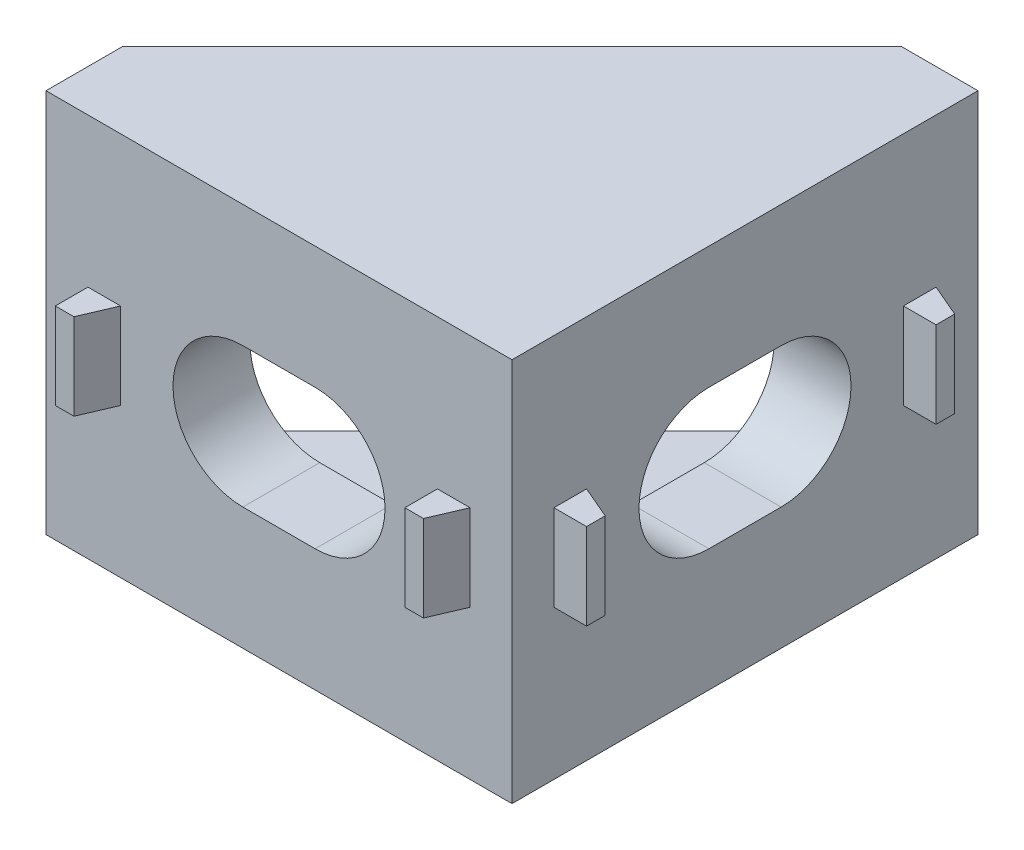
ISO-10303-21;
HEADER;
FILE_DESCRIPTION(('STEP AP214'),'2;1');
FILE_NAME('part.step','',(''),(''),'','','');
FILE_SCHEMA(('AUTOMOTIVE_DESIGN { 1 0 10303 214 1 1 1 1 }'));
ENDSEC;
DATA;
#1=APPLICATION_CONTEXT('core data for automotive mechanical design processes');
#2=APPLICATION_PROTOCOL_DEFINITION('international standard','automotive_design',2000,#1);
#3=PRODUCT_CONTEXT('',#1,'mechanical');
#4=PRODUCT('Part','Part','',(#3));
#5=PRODUCT_RELATED_PRODUCT_CATEGORY('part','',(#4));
#6=PRODUCT_DEFINITION_FORMATION('','',#4);
#7=PRODUCT_DEFINITION_CONTEXT('part definition',#1,'design');
#8=PRODUCT_DEFINITION('design','',#6,#7);
#9=PRODUCT_DEFINITION_SHAPE('','',#8);
#10=(LENGTH_UNIT() NAMED_UNIT(*) SI_UNIT(.MILLI.,.METRE.));
#11=(NAMED_UNIT(*) PLANE_ANGLE_UNIT() SI_UNIT($,.RADIAN.));
#12=(NAMED_UNIT(*) SI_UNIT($,.STERADIAN.) SOLID_ANGLE_UNIT());
#13=UNCERTAINTY_MEASURE_WITH_UNIT(LENGTH_MEASURE(1.E-05),#10,'distance_accuracy_value','');
#14=(GEOMETRIC_REPRESENTATION_CONTEXT(3) GLOBAL_UNCERTAINTY_ASSIGNED_CONTEXT((#13)) GLOBAL_UNIT_ASSIGNED_CONTEXT((#10,
#11,#12)) REPRESENTATION_CONTEXT('',''));
#15=CARTESIAN_POINT('',(0.,0.,0.));
#16=DIRECTION('',(0.,0.,1.));
#17=DIRECTION('',(1.,0.,0.));
#18=AXIS2_PLACEMENT_3D('',#15,#16,#17);
#19=CARTESIAN_POINT('',(0.,0.,0.));
#20=DIRECTION('',(0.,0.,-1.));
#21=DIRECTION('',(-1.,0.,0.));
#22=AXIS2_PLACEMENT_3D('',#19,#20,#21);
#23=PLANE('',#22);
#24=DIRECTION('',(1.,0.,0.));
#25=VECTOR('',#24,1.);
#26=CARTESIAN_POINT('',(-10.,6.05,0.));
#27=LINE('',#26,#25);
#28=CARTESIAN_POINT('',(-10.,6.05,0.));
#29=VERTEX_POINT('',#28);
#30=CARTESIAN_POINT('',(6.7,6.05,0.));
#31=VERTEX_POINT('',#30);
#32=EDGE_CURVE('E259',#29,#31,#27,.T.);
#33=ORIENTED_EDGE('',*,*,#32,.T.);
#34=DIRECTION('',(0.,-1.,0.));
#35=VECTOR('',#34,1.);
#36=CARTESIAN_POINT('',(6.7,0.,0.));
#37=LINE('',#36,#35);
#38=CARTESIAN_POINT('',(6.7,-6.05,0.));
#39=VERTEX_POINT('',#38);
#40=EDGE_CURVE('E275',#31,#39,#37,.T.);
#41=ORIENTED_EDGE('',*,*,#40,.T.);
#42=DIRECTION('',(-1.,0.,0.));
#43=VECTOR('',#42,1.);
#44=CARTESIAN_POINT('',(-10.,-6.05,0.));
#45=LINE('',#44,#43);
#46=CARTESIAN_POINT('',(-10.,-6.05,0.));
#47=VERTEX_POINT('',#46);
#48=EDGE_CURVE('E420',#39,#47,#45,.T.);
#49=ORIENTED_EDGE('',*,*,#48,.T.);
#50=DIRECTION('',(0.,-1.,0.));
#51=VECTOR('',#50,1.);
#52=CARTESIAN_POINT('',(-10.,-8.25,0.));
#53=LINE('',#52,#51);
#54=EDGE_CURVE('E390',#29,#47,#53,.T.);
#55=ORIENTED_EDGE('',*,*,#54,.F.);
#56=EDGE_LOOP('',(#33,#41,#49,#55));
#57=FACE_BOUND('',#56,.T.);
#58=DIRECTION('',(-1.,0.,0.));
#59=VECTOR('',#58,1.);
#60=CARTESIAN_POINT('',(-1.55,3.,0.));
#61=LINE('',#60,#59);
#62=CARTESIAN_POINT('',(1.55,3.,0.));
#63=VERTEX_POINT('',#62);
#64=CARTESIAN_POINT('',(-1.55,3.,0.));
#65=VERTEX_POINT('',#64);
#66=EDGE_CURVE('E363',#63,#65,#61,.T.);
#67=ORIENTED_EDGE('',*,*,#66,.T.);
#68=CARTESIAN_POINT('',(-1.55,0.,0.));
#69=DIRECTION('',(0.,0.,1.));
#70=DIRECTION('',(1.,0.,0.));
#71=AXIS2_PLACEMENT_3D('',#68,#69,#70);
#72=CIRCLE('',#71,3.);
#73=CARTESIAN_POINT('',(-1.55,-3.,0.));
#74=VERTEX_POINT('',#73);
#75=EDGE_CURVE('E359',#65,#74,#72,.T.);
#76=ORIENTED_EDGE('',*,*,#75,.T.);
#77=DIRECTION('',(1.,0.,0.));
#78=VECTOR('',#77,1.);
#79=CARTESIAN_POINT('',(-1.55,-3.,0.));
#80=LINE('',#79,#78);
#81=CARTESIAN_POINT('',(1.55,-3.,0.));
#82=VERTEX_POINT('',#81);
#83=EDGE_CURVE('E373',#74,#82,#80,.T.);
#84=ORIENTED_EDGE('',*,*,#83,.T.);
#85=CARTESIAN_POINT('',(1.55,0.,0.));
#86=DIRECTION('',(0.,0.,1.));
#87=DIRECTION('',(1.,0.,0.));
#88=AXIS2_PLACEMENT_3D('',#85,#86,#87);
#89=CIRCLE('',#88,3.);
#90=EDGE_CURVE('E376',#82,#63,#89,.T.);
#91=ORIENTED_EDGE('',*,*,#90,.T.);
#92=EDGE_LOOP('',(#67,#76,#84,#91));
#93=FACE_BOUND('',#92,.T.);
#94=ADVANCED_FACE('F40',(#57,#93),#23,.T.);
#95=CARTESIAN_POINT('',(6.7,0.,0.));
#96=DIRECTION('',(1.,0.,0.));
#97=DIRECTION('',(0.,0.,-1.));
#98=AXIS2_PLACEMENT_3D('',#95,#96,#97);
#99=PLANE('',#98);
#100=DIRECTION('',(0.,0.,1.));
#101=VECTOR('',#100,1.);
#102=CARTESIAN_POINT('',(6.7,3.,-5.15));
#103=LINE('',#102,#101);
#104=CARTESIAN_POINT('',(6.7,3.00000000000001,-8.25));
#105=VERTEX_POINT('',#104);
#106=CARTESIAN_POINT('',(6.7,3.,-5.15));
#107=VERTEX_POINT('',#106);
#108=EDGE_CURVE('E499',#105,#107,#103,.T.);
#109=ORIENTED_EDGE('',*,*,#108,.T.);
#110=CARTESIAN_POINT('',(6.7,0.,-5.15));
#111=DIRECTION('',(1.,0.,0.));
#112=DIRECTION('',(0.,0.,-1.));
#113=AXIS2_PLACEMENT_3D('',#110,#111,#112);
#114=CIRCLE('',#113,3.);
#115=CARTESIAN_POINT('',(6.7,-3.,-5.15));
#116=VERTEX_POINT('',#115);
#117=EDGE_CURVE('E489',#107,#116,#114,.T.);
#118=ORIENTED_EDGE('',*,*,#117,.T.);
#119=DIRECTION('',(0.,0.,-1.));
#120=VECTOR('',#119,1.);
#121=CARTESIAN_POINT('',(6.7,-3.,-5.15));
#122=LINE('',#121,#120);
#123=CARTESIAN_POINT('',(6.7,-3.,-8.25));
#124=VERTEX_POINT('',#123);
#125=EDGE_CURVE('E492',#116,#124,#122,.T.);
#126=ORIENTED_EDGE('',*,*,#125,.T.);
#127=CARTESIAN_POINT('',(6.7,0.,-8.25));
#128=DIRECTION('',(1.,0.,0.));
#129=DIRECTION('',(0.,0.,-1.));
#130=AXIS2_PLACEMENT_3D('',#127,#128,#129);
#131=CIRCLE('',#130,3.);
#132=EDGE_CURVE('E496',#124,#105,#131,.T.);
#133=ORIENTED_EDGE('',*,*,#132,.T.);
#134=EDGE_LOOP('',(#109,#118,#126,#133));
#135=FACE_BOUND('',#134,.T.);
#136=ORIENTED_EDGE('',*,*,#40,.F.);
#137=DIRECTION('',(0.,0.,-1.));
#138=VECTOR('',#137,1.);
#139=CARTESIAN_POINT('',(6.7,6.05,0.));
#140=LINE('',#139,#138);
#141=CARTESIAN_POINT('',(6.7,6.05,-16.7));
#142=VERTEX_POINT('',#141);
#143=EDGE_CURVE('E264',#31,#142,#140,.T.);
#144=ORIENTED_EDGE('',*,*,#143,.T.);
#145=DIRECTION('',(0.,1.,0.));
#146=VECTOR('',#145,1.);
#147=CARTESIAN_POINT('',(6.7,-8.25,-16.7));
#148=LINE('',#147,#146);
#149=CARTESIAN_POINT('',(6.7,-6.05,-16.7));
#150=VERTEX_POINT('',#149);
#151=EDGE_CURVE('E273',#150,#142,#148,.T.);
#152=ORIENTED_EDGE('',*,*,#151,.F.);
#153=DIRECTION('',(0.,0.,1.));
#154=VECTOR('',#153,1.);
#155=CARTESIAN_POINT('',(6.7,-6.05,0.));
#156=LINE('',#155,#154);
#157=EDGE_CURVE('E418',#150,#39,#156,.T.);
#158=ORIENTED_EDGE('',*,*,#157,.T.);
#159=EDGE_LOOP('',(#136,#144,#152,#158));
#160=FACE_BOUND('',#159,.T.);
#161=ADVANCED_FACE('F271',(#135,#160),#99,.F.);
#162=CARTESIAN_POINT('',(10.,-8.25,3.3));
#163=DIRECTION('',(-1.,0.,0.));
#164=DIRECTION('',(0.,0.,1.));
#165=AXIS2_PLACEMENT_3D('',#162,#163,#164);
#166=PLANE('',#165);
#167=DIRECTION('',(0.,1.,0.));
#168=VECTOR('',#167,1.);
#169=CARTESIAN_POINT('',(10.,-1.85,0.1));
#170=LINE('',#169,#168);
#171=CARTESIAN_POINT('',(10.,-1.85,0.1));
#172=VERTEX_POINT('',#171);
#173=CARTESIAN_POINT('',(10.,1.85,0.1));
#174=VERTEX_POINT('',#173);
#175=EDGE_CURVE('E459',#172,#174,#170,.T.);
#176=ORIENTED_EDGE('',*,*,#175,.F.);
#177=DIRECTION('',(0.,0.,-1.));
#178=VECTOR('',#177,1.);
#179=CARTESIAN_POINT('',(10.,-1.85,1.5));
#180=LINE('',#179,#178);
#181=CARTESIAN_POINT('',(10.,-1.85,1.5));
#182=VERTEX_POINT('',#181);
#183=EDGE_CURVE('E468',#182,#172,#180,.T.);
#184=ORIENTED_EDGE('',*,*,#183,.F.);
#185=DIRECTION('',(0.,-1.,0.));
#186=VECTOR('',#185,1.);
#187=CARTESIAN_POINT('',(10.,-1.85,1.5));
#188=LINE('',#187,#186);
#189=CARTESIAN_POINT('',(10.,1.85,1.5));
#190=VERTEX_POINT('',#189);
#191=EDGE_CURVE('E478',#190,#182,#188,.T.);
#192=ORIENTED_EDGE('',*,*,#191,.F.);
#193=DIRECTION('',(0.,0.,1.));
#194=VECTOR('',#193,1.);
#195=CARTESIAN_POINT('',(10.,1.85,1.5));
#196=LINE('',#195,#194);
#197=EDGE_CURVE('E475',#174,#190,#196,.T.);
#198=ORIENTED_EDGE('',*,*,#197,.F.);
#199=EDGE_LOOP('',(#176,#184,#192,#198));
#200=FACE_BOUND('',#199,.T.);
#201=DIRECTION('',(0.,0.,-1.));
#202=VECTOR('',#201,1.);
#203=CARTESIAN_POINT('',(10.,-8.25,3.3));
#204=LINE('',#203,#202);
#205=CARTESIAN_POINT('',(10.,-8.25,3.3));
#206=VERTEX_POINT('',#205);
#207=CARTESIAN_POINT('',(10.,-8.25,-16.7));
#208=VERTEX_POINT('',#207);
#209=EDGE_CURVE('E401',#206,#208,#204,.T.);
#210=ORIENTED_EDGE('',*,*,#209,.T.);
#211=DIRECTION('',(0.,1.,0.));
#212=VECTOR('',#211,1.);
#213=CARTESIAN_POINT('',(10.,-8.25,-16.7));
#214=LINE('',#213,#212);
#215=CARTESIAN_POINT('',(10.,8.25,-16.7));
#216=VERTEX_POINT('',#215);
#217=EDGE_CURVE('E282',#208,#216,#214,.T.);
#218=ORIENTED_EDGE('',*,*,#217,.T.);
#219=DIRECTION('',(0.,0.,-1.));
#220=VECTOR('',#219,1.);
#221=CARTESIAN_POINT('',(10.,8.25,3.3));
#222=LINE('',#221,#220);
#223=CARTESIAN_POINT('',(10.,8.25,3.3));
#224=VERTEX_POINT('',#223);
#225=EDGE_CURVE('E11',#224,#216,#222,.T.);
#226=ORIENTED_EDGE('',*,*,#225,.F.);
#227=DIRECTION('',(0.,1.,0.));
#228=VECTOR('',#227,1.);
#229=CARTESIAN_POINT('',(10.,-8.25,3.3));
#230=LINE('',#229,#228);
#231=EDGE_CURVE('E391',#206,#224,#230,.T.);
#232=ORIENTED_EDGE('',*,*,#231,.F.);
#233=EDGE_LOOP('',(#210,#218,#226,#232));
#234=FACE_BOUND('',#233,.T.);
#235=CARTESIAN_POINT('',(10.,0.,-5.15));
#236=DIRECTION('',(1.,0.,0.));
#237=DIRECTION('',(0.,0.,-1.));
#238=AXIS2_PLACEMENT_3D('',#235,#236,#237);
#239=CIRCLE('',#238,3.);
#240=CARTESIAN_POINT('',(10.,3.,-5.15));
#241=VERTEX_POINT('',#240);
#242=CARTESIAN_POINT('',(10.,-3.,-5.15));
#243=VERTEX_POINT('',#242);
#244=EDGE_CURVE('E488',#241,#243,#239,.T.);
#245=ORIENTED_EDGE('',*,*,#244,.F.);
#246=DIRECTION('',(0.,0.,1.));
#247=VECTOR('',#246,1.);
#248=CARTESIAN_POINT('',(10.,3.,-5.15));
#249=LINE('',#248,#247);
#250=CARTESIAN_POINT('',(10.,3.00000000000001,-8.25));
#251=VERTEX_POINT('',#250);
#252=EDGE_CURVE('E493',#251,#241,#249,.T.);
#253=ORIENTED_EDGE('',*,*,#252,.F.);
#254=CARTESIAN_POINT('',(10.,0.,-8.25));
#255=DIRECTION('',(1.,0.,0.));
#256=DIRECTION('',(0.,0.,-1.));
#257=AXIS2_PLACEMENT_3D('',#254,#255,#256);
#258=CIRCLE('',#257,3.);
#259=CARTESIAN_POINT('',(10.,-3.,-8.25));
#260=VERTEX_POINT('',#259);
#261=EDGE_CURVE('E506',#260,#251,#258,.T.);
#262=ORIENTED_EDGE('',*,*,#261,.F.);
#263=DIRECTION('',(0.,0.,-1.));
#264=VECTOR('',#263,1.);
#265=CARTESIAN_POINT('',(10.,-3.,-5.15));
#266=LINE('',#265,#264);
#267=EDGE_CURVE('E503',#243,#260,#266,.T.);
#268=ORIENTED_EDGE('',*,*,#267,.F.);
#269=EDGE_LOOP('',(#245,#253,#262,#268));
#270=FACE_BOUND('',#269,.T.);
#271=DIRECTION('',(0.,1.,0.));
#272=VECTOR('',#271,1.);
#273=CARTESIAN_POINT('',(10.,-1.85,-14.9));
#274=LINE('',#273,#272);
#275=CARTESIAN_POINT('',(10.,-1.85,-14.9));
#276=VERTEX_POINT('',#275);
#277=CARTESIAN_POINT('',(10.,1.85,-14.9));
#278=VERTEX_POINT('',#277);
#279=EDGE_CURVE('E457',#276,#278,#274,.T.);
#280=ORIENTED_EDGE('',*,*,#279,.F.);
#281=DIRECTION('',(0.,0.,-1.));
#282=VECTOR('',#281,1.);
#283=CARTESIAN_POINT('',(10.,-1.85,-13.5));
#284=LINE('',#283,#282);
#285=CARTESIAN_POINT('',(10.,-1.85,-13.5));
#286=VERTEX_POINT('',#285);
#287=EDGE_CURVE('E447',#286,#276,#284,.T.);
#288=ORIENTED_EDGE('',*,*,#287,.F.);
#289=DIRECTION('',(0.,-1.,0.));
#290=VECTOR('',#289,1.);
#291=CARTESIAN_POINT('',(10.,-1.85,-13.5));
#292=LINE('',#291,#290);
#293=CARTESIAN_POINT('',(10.,1.85,-13.5));
#294=VERTEX_POINT('',#293);
#295=EDGE_CURVE('E450',#294,#286,#292,.T.);
#296=ORIENTED_EDGE('',*,*,#295,.F.);
#297=DIRECTION('',(0.,0.,1.));
#298=VECTOR('',#297,1.);
#299=CARTESIAN_POINT('',(10.,1.85,-13.5));
#300=LINE('',#299,#298);
#301=EDGE_CURVE('E454',#278,#294,#300,.T.);
#302=ORIENTED_EDGE('',*,*,#301,.F.);
#303=EDGE_LOOP('',(#280,#288,#296,#302));
#304=FACE_BOUND('',#303,.T.);
#305=ADVANCED_FACE('F42',(#200,#234,#270,#304),#166,.F.);
#306=CARTESIAN_POINT('',(0.,0.,3.3));
#307=DIRECTION('',(0.,0.,-1.));
#308=DIRECTION('',(-1.,0.,0.));
#309=AXIS2_PLACEMENT_3D('',#306,#307,#308);
#310=PLANE('',#309);
#311=DIRECTION('',(0.,1.,0.));
#312=VECTOR('',#311,1.);
#313=CARTESIAN_POINT('',(8.2,-1.85,3.3));
#314=LINE('',#313,#312);
#315=CARTESIAN_POINT('',(8.2,-1.85,3.3));
#316=VERTEX_POINT('',#315);
#317=CARTESIAN_POINT('',(8.2,1.85,3.3));
#318=VERTEX_POINT('',#317);
#319=EDGE_CURVE('E330',#316,#318,#314,.T.);
#320=ORIENTED_EDGE('',*,*,#319,.F.);
#321=DIRECTION('',(1.,0.,0.));
#322=VECTOR('',#321,1.);
#323=CARTESIAN_POINT('',(6.8,-1.85,3.3));
#324=LINE('',#323,#322);
#325=CARTESIAN_POINT('',(6.8,-1.85,3.3));
#326=VERTEX_POINT('',#325);
#327=EDGE_CURVE('E339',#326,#316,#324,.T.);
#328=ORIENTED_EDGE('',*,*,#327,.F.);
#329=DIRECTION('',(0.,-1.,0.));
#330=VECTOR('',#329,1.);
#331=CARTESIAN_POINT('',(6.8,-1.85,3.3));
#332=LINE('',#331,#330);
#333=CARTESIAN_POINT('',(6.8,1.85,3.3));
#334=VERTEX_POINT('',#333);
#335=EDGE_CURVE('E349',#334,#326,#332,.T.);
#336=ORIENTED_EDGE('',*,*,#335,.F.);
#337=DIRECTION('',(-1.,0.,0.));
#338=VECTOR('',#337,1.);
#339=CARTESIAN_POINT('',(6.8,1.85,3.3));
#340=LINE('',#339,#338);
#341=EDGE_CURVE('E346',#318,#334,#340,.T.);
#342=ORIENTED_EDGE('',*,*,#341,.F.);
#343=EDGE_LOOP('',(#320,#328,#336,#342));
#344=FACE_BOUND('',#343,.T.);
#345=DIRECTION('',(-1.,0.,0.));
#346=VECTOR('',#345,1.);
#347=CARTESIAN_POINT('',(-10.,8.25,3.3));
#348=LINE('',#347,#346);
#349=CARTESIAN_POINT('',(-10.,8.25,3.3));
#350=VERTEX_POINT('',#349);
#351=EDGE_CURVE('E394',#224,#350,#348,.T.);
#352=ORIENTED_EDGE('',*,*,#351,.T.);
#353=DIRECTION('',(0.,-1.,0.));
#354=VECTOR('',#353,1.);
#355=CARTESIAN_POINT('',(-10.,-8.25,3.3));
#356=LINE('',#355,#354);
#357=CARTESIAN_POINT('',(-10.,-8.25,3.3));
#358=VERTEX_POINT('',#357);
#359=EDGE_CURVE('E397',#350,#358,#356,.T.);
#360=ORIENTED_EDGE('',*,*,#359,.T.);
#361=DIRECTION('',(1.,0.,0.));
#362=VECTOR('',#361,1.);
#363=CARTESIAN_POINT('',(-10.,-8.25,3.3));
#364=LINE('',#363,#362);
#365=EDGE_CURVE('E399',#358,#206,#364,.T.);
#366=ORIENTED_EDGE('',*,*,#365,.T.);
#367=ORIENTED_EDGE('',*,*,#231,.T.);
#368=EDGE_LOOP('',(#352,#360,#366,#367));
#369=FACE_BOUND('',#368,.T.);
#370=DIRECTION('',(0.,1.,0.));
#371=VECTOR('',#370,1.);
#372=CARTESIAN_POINT('',(-6.8,-1.85,3.3));
#373=LINE('',#372,#371);
#374=CARTESIAN_POINT('',(-6.8,-1.85,3.3));
#375=VERTEX_POINT('',#374);
#376=CARTESIAN_POINT('',(-6.8,1.85,3.3));
#377=VERTEX_POINT('',#376);
#378=EDGE_CURVE('E328',#375,#377,#373,.T.);
#379=ORIENTED_EDGE('',*,*,#378,.F.);
#380=DIRECTION('',(1.,0.,0.));
#381=VECTOR('',#380,1.);
#382=CARTESIAN_POINT('',(-8.2,-1.85,3.3));
#383=LINE('',#382,#381);
#384=CARTESIAN_POINT('',(-8.2,-1.85,3.3));
#385=VERTEX_POINT('',#384);
#386=EDGE_CURVE('E318',#385,#375,#383,.T.);
#387=ORIENTED_EDGE('',*,*,#386,.F.);
#388=DIRECTION('',(0.,-1.,0.));
#389=VECTOR('',#388,1.);
#390=CARTESIAN_POINT('',(-8.2,-1.85,3.3));
#391=LINE('',#390,#389);
#392=CARTESIAN_POINT('',(-8.2,1.85,3.3));
#393=VERTEX_POINT('',#392);
#394=EDGE_CURVE('E321',#393,#385,#391,.T.);
#395=ORIENTED_EDGE('',*,*,#394,.F.);
#396=DIRECTION('',(-1.,0.,0.));
#397=VECTOR('',#396,1.);
#398=CARTESIAN_POINT('',(-8.2,1.85,3.3));
#399=LINE('',#398,#397);
#400=EDGE_CURVE('E325',#377,#393,#399,.T.);
#401=ORIENTED_EDGE('',*,*,#400,.F.);
#402=EDGE_LOOP('',(#379,#387,#395,#401));
#403=FACE_BOUND('',#402,.T.);
#404=CARTESIAN_POINT('',(-1.55,0.,3.3));
#405=DIRECTION('',(0.,0.,1.));
#406=DIRECTION('',(1.,0.,0.));
#407=AXIS2_PLACEMENT_3D('',#404,#405,#406);
#408=CIRCLE('',#407,3.);
#409=CARTESIAN_POINT('',(-1.55,3.,3.3));
#410=VERTEX_POINT('',#409);
#411=CARTESIAN_POINT('',(-1.55,-3.,3.3));
#412=VERTEX_POINT('',#411);
#413=EDGE_CURVE('E360',#410,#412,#408,.T.);
#414=ORIENTED_EDGE('',*,*,#413,.F.);
#415=DIRECTION('',(-1.,0.,0.));
#416=VECTOR('',#415,1.);
#417=CARTESIAN_POINT('',(-1.55,3.,3.3));
#418=LINE('',#417,#416);
#419=CARTESIAN_POINT('',(1.55,3.,3.3));
#420=VERTEX_POINT('',#419);
#421=EDGE_CURVE('E368',#420,#410,#418,.T.);
#422=ORIENTED_EDGE('',*,*,#421,.F.);
#423=CARTESIAN_POINT('',(1.55,0.,3.3));
#424=DIRECTION('',(0.,0.,1.));
#425=DIRECTION('',(1.,0.,0.));
#426=AXIS2_PLACEMENT_3D('',#423,#424,#425);
#427=CIRCLE('',#426,3.);
#428=CARTESIAN_POINT('',(1.55,-3.,3.3));
#429=VERTEX_POINT('',#428);
#430=EDGE_CURVE('E365',#429,#420,#427,.T.);
#431=ORIENTED_EDGE('',*,*,#430,.F.);
#432=DIRECTION('',(1.,0.,0.));
#433=VECTOR('',#432,1.);
#434=CARTESIAN_POINT('',(-1.55,-3.,3.3));
#435=LINE('',#434,#433);
#436=EDGE_CURVE('E362',#412,#429,#435,.T.);
#437=ORIENTED_EDGE('',*,*,#436,.F.);
#438=EDGE_LOOP('',(#414,#422,#431,#437));
#439=FACE_BOUND('',#438,.T.);
#440=ADVANCED_FACE('F554',(#344,#369,#403,#439),#310,.F.);
#441=CARTESIAN_POINT('',(-10.,8.25,3.3));
#442=DIRECTION('',(0.,-1.,0.));
#443=DIRECTION('',(0.,0.,-1.));
#444=AXIS2_PLACEMENT_3D('',#441,#442,#443);
#445=PLANE('',#444);
#446=ORIENTED_EDGE('',*,*,#225,.T.);
#447=DIRECTION('',(1.,0.,0.));
#448=VECTOR('',#447,1.);
#449=CARTESIAN_POINT('',(6.7,8.25,-16.7));
#450=LINE('',#449,#448);
#451=CARTESIAN_POINT('',(6.7,8.25,-16.7));
#452=VERTEX_POINT('',#451);
#453=EDGE_CURVE('E292',#452,#216,#450,.T.);
#454=ORIENTED_EDGE('',*,*,#453,.F.);
#455=DIRECTION('',(-0.707106781186547,0.,0.707106781186547));
#456=VECTOR('',#455,1.);
#457=CARTESIAN_POINT('',(6.7,8.25,-16.7));
#458=LINE('',#457,#456);
#459=CARTESIAN_POINT('',(-10.,8.25,0.));
#460=VERTEX_POINT('',#459);
#461=EDGE_CURVE('E253',#452,#460,#458,.T.);
#462=ORIENTED_EDGE('',*,*,#461,.T.);
#463=DIRECTION('',(0.,0.,-1.));
#464=VECTOR('',#463,1.);
#465=CARTESIAN_POINT('',(-10.,8.25,3.3));
#466=LINE('',#465,#464);
#467=EDGE_CURVE('E48',#350,#460,#466,.T.);
#468=ORIENTED_EDGE('',*,*,#467,.F.);
#469=ORIENTED_EDGE('',*,*,#351,.F.);
#470=EDGE_LOOP('',(#446,#454,#462,#468,#469));
#471=FACE_BOUND('',#470,.T.);
#472=ADVANCED_FACE('F414',(#471),#445,.F.);
#473=CARTESIAN_POINT('',(-10.,-8.25,3.3));
#474=DIRECTION('',(1.,0.,0.));
#475=DIRECTION('',(0.,0.,-1.));
#476=AXIS2_PLACEMENT_3D('',#473,#474,#475);
#477=PLANE('',#476);
#478=EDGE_CURVE('E395',#460,#29,#53,.T.);
#479=ORIENTED_EDGE('',*,*,#478,.T.);
#480=ORIENTED_EDGE('',*,*,#54,.T.);
#481=DIRECTION('',(0.,-1.,0.));
#482=VECTOR('',#481,1.);
#483=CARTESIAN_POINT('',(-10.,-6.05,0.));
#484=LINE('',#483,#482);
#485=CARTESIAN_POINT('',(-10.,-8.25,0.));
#486=VERTEX_POINT('',#485);
#487=EDGE_CURVE('E426',#47,#486,#484,.T.);
#488=ORIENTED_EDGE('',*,*,#487,.T.);
#489=DIRECTION('',(0.,0.,-1.));
#490=VECTOR('',#489,1.);
#491=CARTESIAN_POINT('',(-10.,-8.25,3.3));
#492=LINE('',#491,#490);
#493=EDGE_CURVE('E405',#358,#486,#492,.T.);
#494=ORIENTED_EDGE('',*,*,#493,.F.);
#495=ORIENTED_EDGE('',*,*,#359,.F.);
#496=ORIENTED_EDGE('',*,*,#467,.T.);
#497=EDGE_LOOP('',(#479,#480,#488,#494,#495,#496));
#498=FACE_BOUND('',#497,.T.);
#499=ADVANCED_FACE('F411',(#498),#477,.F.);
#500=CARTESIAN_POINT('',(-10.,-8.25,3.3));
#501=DIRECTION('',(0.,1.,0.));
#502=DIRECTION('',(0.,0.,1.));
#503=AXIS2_PLACEMENT_3D('',#500,#501,#502);
#504=PLANE('',#503);
#505=ORIENTED_EDGE('',*,*,#209,.F.);
#506=ORIENTED_EDGE('',*,*,#365,.F.);
#507=ORIENTED_EDGE('',*,*,#493,.T.);
#508=DIRECTION('',(0.707106781186547,0.,-0.707106781186547));
#509=VECTOR('',#508,1.);
#510=CARTESIAN_POINT('',(6.7,-8.25,-16.7));
#511=LINE('',#510,#509);
#512=CARTESIAN_POINT('',(6.7,-8.25,-16.7));
#513=VERTEX_POINT('',#512);
#514=EDGE_CURVE('E258',#486,#513,#511,.T.);
#515=ORIENTED_EDGE('',*,*,#514,.T.);
#516=DIRECTION('',(1.,0.,0.));
#517=VECTOR('',#516,1.);
#518=CARTESIAN_POINT('',(6.7,-8.25,-16.7));
#519=LINE('',#518,#517);
#520=EDGE_CURVE('E284',#513,#208,#519,.T.);
#521=ORIENTED_EDGE('',*,*,#520,.T.);
#522=EDGE_LOOP('',(#505,#506,#507,#515,#521));
#523=FACE_BOUND('',#522,.T.);
#524=ADVANCED_FACE('F556',(#523),#504,.F.);
#525=CARTESIAN_POINT('',(-1.55,0.,3.3));
#526=DIRECTION('',(0.,0.,-1.));
#527=DIRECTION('',(-1.,0.,0.));
#528=AXIS2_PLACEMENT_3D('',#525,#526,#527);
#529=CYLINDRICAL_SURFACE('',#528,3.);
#530=ORIENTED_EDGE('',*,*,#75,.F.);
#531=DIRECTION('',(0.,0.,-1.));
#532=VECTOR('',#531,1.);
#533=CARTESIAN_POINT('',(-1.55,3.,3.3));
#534=LINE('',#533,#532);
#535=EDGE_CURVE('E370',#410,#65,#534,.T.);
#536=ORIENTED_EDGE('',*,*,#535,.F.);
#537=ORIENTED_EDGE('',*,*,#413,.T.);
#538=DIRECTION('',(0.,0.,-1.));
#539=VECTOR('',#538,1.);
#540=CARTESIAN_POINT('',(-1.55,-3.,3.3));
#541=LINE('',#540,#539);
#542=EDGE_CURVE('E387',#412,#74,#541,.T.);
#543=ORIENTED_EDGE('',*,*,#542,.T.);
#544=EDGE_LOOP('',(#530,#536,#537,#543));
#545=FACE_BOUND('',#544,.T.);
#546=ADVANCED_FACE('F559',(#545),#529,.F.);
#547=CARTESIAN_POINT('',(-1.55,-3.,3.3));
#548=DIRECTION('',(0.,1.,0.));
#549=DIRECTION('',(0.,0.,1.));
#550=AXIS2_PLACEMENT_3D('',#547,#548,#549);
#551=PLANE('',#550);
#552=ORIENTED_EDGE('',*,*,#83,.F.);
#553=ORIENTED_EDGE('',*,*,#542,.F.);
#554=ORIENTED_EDGE('',*,*,#436,.T.);
#555=DIRECTION('',(0.,0.,-1.));
#556=VECTOR('',#555,1.);
#557=CARTESIAN_POINT('',(1.55,-3.,3.3));
#558=LINE('',#557,#556);
#559=EDGE_CURVE('E385',#429,#82,#558,.T.);
#560=ORIENTED_EDGE('',*,*,#559,.T.);
#561=EDGE_LOOP('',(#552,#553,#554,#560));
#562=FACE_BOUND('',#561,.T.);
#563=ADVANCED_FACE('F586',(#562),#551,.T.);
#564=CARTESIAN_POINT('',(1.55,0.,3.3));
#565=DIRECTION('',(0.,0.,-1.));
#566=DIRECTION('',(-1.,0.,0.));
#567=AXIS2_PLACEMENT_3D('',#564,#565,#566);
#568=CYLINDRICAL_SURFACE('',#567,3.);
#569=ORIENTED_EDGE('',*,*,#90,.F.);
#570=ORIENTED_EDGE('',*,*,#559,.F.);
#571=ORIENTED_EDGE('',*,*,#430,.T.);
#572=DIRECTION('',(0.,0.,-1.));
#573=VECTOR('',#572,1.);
#574=CARTESIAN_POINT('',(1.55,3.,3.3));
#575=LINE('',#574,#573);
#576=EDGE_CURVE('E383',#420,#63,#575,.T.);
#577=ORIENTED_EDGE('',*,*,#576,.T.);
#578=EDGE_LOOP('',(#569,#570,#571,#577));
#579=FACE_BOUND('',#578,.T.);
#580=ADVANCED_FACE('F593',(#579),#568,.F.);
#581=CARTESIAN_POINT('',(-1.55,3.,3.3));
#582=DIRECTION('',(0.,-1.,0.));
#583=DIRECTION('',(0.,0.,-1.));
#584=AXIS2_PLACEMENT_3D('',#581,#582,#583);
#585=PLANE('',#584);
#586=ORIENTED_EDGE('',*,*,#66,.F.);
#587=ORIENTED_EDGE('',*,*,#576,.F.);
#588=ORIENTED_EDGE('',*,*,#421,.T.);
#589=ORIENTED_EDGE('',*,*,#535,.T.);
#590=EDGE_LOOP('',(#586,#587,#588,#589));
#591=FACE_BOUND('',#590,.T.);
#592=ADVANCED_FACE('F591',(#591),#585,.T.);
#593=CARTESIAN_POINT('',(6.8,1.85,4.7));
#594=DIRECTION('',(0.,-1.,0.));
#595=DIRECTION('',(0.,0.,-1.));
#596=AXIS2_PLACEMENT_3D('',#593,#594,#595);
#597=PLANE('',#596);
#598=DIRECTION('',(-1.,0.,0.));
#599=VECTOR('',#598,1.);
#600=CARTESIAN_POINT('',(6.8,1.85,4.7));
#601=LINE('',#600,#599);
#602=CARTESIAN_POINT('',(7.6,1.85,4.7));
#603=VERTEX_POINT('',#602);
#604=CARTESIAN_POINT('',(6.8,1.85,4.7));
#605=VERTEX_POINT('',#604);
#606=EDGE_CURVE('E336',#603,#605,#601,.T.);
#607=ORIENTED_EDGE('',*,*,#606,.F.);
#608=DIRECTION('',(0.393919298579167,0.,-0.919145030018058));
#609=VECTOR('',#608,1.);
#610=CARTESIAN_POINT('',(8.2,1.85,3.3));
#611=LINE('',#610,#609);
#612=EDGE_CURVE('E305',#603,#318,#611,.T.);
#613=ORIENTED_EDGE('',*,*,#612,.T.);
#614=ORIENTED_EDGE('',*,*,#341,.T.);
#615=DIRECTION('',(0.,0.,-1.));
#616=VECTOR('',#615,1.);
#617=CARTESIAN_POINT('',(6.8,1.85,4.7));
#618=LINE('',#617,#616);
#619=EDGE_CURVE('E356',#605,#334,#618,.T.);
#620=ORIENTED_EDGE('',*,*,#619,.F.);
#621=EDGE_LOOP('',(#607,#613,#614,#620));
#622=FACE_BOUND('',#621,.T.);
#623=ADVANCED_FACE('F600',(#622),#597,.F.);
#624=CARTESIAN_POINT('',(6.8,-1.85,4.7));
#625=DIRECTION('',(1.,0.,0.));
#626=DIRECTION('',(0.,0.,-1.));
#627=AXIS2_PLACEMENT_3D('',#624,#625,#626);
#628=PLANE('',#627);
#629=ORIENTED_EDGE('',*,*,#335,.T.);
#630=DIRECTION('',(0.,0.,-1.));
#631=VECTOR('',#630,1.);
#632=CARTESIAN_POINT('',(6.8,-1.85,4.7));
#633=LINE('',#632,#631);
#634=CARTESIAN_POINT('',(6.8,-1.85,4.7));
#635=VERTEX_POINT('',#634);
#636=EDGE_CURVE('E344',#635,#326,#633,.T.);
#637=ORIENTED_EDGE('',*,*,#636,.F.);
#638=DIRECTION('',(0.,-1.,0.));
#639=VECTOR('',#638,1.);
#640=CARTESIAN_POINT('',(6.8,-1.85,4.7));
#641=LINE('',#640,#639);
#642=EDGE_CURVE('E338',#605,#635,#641,.T.);
#643=ORIENTED_EDGE('',*,*,#642,.F.);
#644=ORIENTED_EDGE('',*,*,#619,.T.);
#645=EDGE_LOOP('',(#629,#637,#643,#644));
#646=FACE_BOUND('',#645,.T.);
#647=ADVANCED_FACE('F633',(#646),#628,.F.);
#648=CARTESIAN_POINT('',(6.8,-1.85,4.7));
#649=DIRECTION('',(0.,1.,0.));
#650=DIRECTION('',(0.,0.,1.));
#651=AXIS2_PLACEMENT_3D('',#648,#649,#650);
#652=PLANE('',#651);
#653=ORIENTED_EDGE('',*,*,#327,.T.);
#654=DIRECTION('',(0.393919298579167,0.,-0.919145030018058));
#655=VECTOR('',#654,1.);
#656=CARTESIAN_POINT('',(8.2,-1.85,3.3));
#657=LINE('',#656,#655);
#658=CARTESIAN_POINT('',(7.6,-1.85,4.7));
#659=VERTEX_POINT('',#658);
#660=EDGE_CURVE('E304',#659,#316,#657,.T.);
#661=ORIENTED_EDGE('',*,*,#660,.F.);
#662=DIRECTION('',(1.,0.,0.));
#663=VECTOR('',#662,1.);
#664=CARTESIAN_POINT('',(6.8,-1.85,4.7));
#665=LINE('',#664,#663);
#666=EDGE_CURVE('E341',#635,#659,#665,.T.);
#667=ORIENTED_EDGE('',*,*,#666,.F.);
#668=ORIENTED_EDGE('',*,*,#636,.T.);
#669=EDGE_LOOP('',(#653,#661,#667,#668));
#670=FACE_BOUND('',#669,.T.);
#671=ADVANCED_FACE('F638',(#670),#652,.F.);
#672=CARTESIAN_POINT('',(0.,0.,4.7));
#673=DIRECTION('',(0.,0.,-1.));
#674=DIRECTION('',(-1.,0.,0.));
#675=AXIS2_PLACEMENT_3D('',#672,#673,#674);
#676=PLANE('',#675);
#677=ORIENTED_EDGE('',*,*,#666,.T.);
#678=DIRECTION('',(0.,-1.,0.));
#679=VECTOR('',#678,1.);
#680=CARTESIAN_POINT('',(7.6,1.85,4.7));
#681=LINE('',#680,#679);
#682=EDGE_CURVE('E308',#603,#659,#681,.T.);
#683=ORIENTED_EDGE('',*,*,#682,.F.);
#684=ORIENTED_EDGE('',*,*,#606,.T.);
#685=ORIENTED_EDGE('',*,*,#642,.T.);
#686=EDGE_LOOP('',(#677,#683,#684,#685));
#687=FACE_BOUND('',#686,.T.);
#688=ADVANCED_FACE('F674',(#687),#676,.F.);
#689=CARTESIAN_POINT('',(-8.2,1.85,4.7));
#690=DIRECTION('',(0.,-1.,0.));
#691=DIRECTION('',(0.,0.,-1.));
#692=AXIS2_PLACEMENT_3D('',#689,#690,#691);
#693=PLANE('',#692);
#694=DIRECTION('',(-1.,0.,0.));
#695=VECTOR('',#694,1.);
#696=CARTESIAN_POINT('',(-8.2,1.85,4.7));
#697=LINE('',#696,#695);
#698=CARTESIAN_POINT('',(-7.4,1.85,4.7));
#699=VERTEX_POINT('',#698);
#700=CARTESIAN_POINT('',(-8.2,1.85,4.7));
#701=VERTEX_POINT('',#700);
#702=EDGE_CURVE('E322',#699,#701,#697,.T.);
#703=ORIENTED_EDGE('',*,*,#702,.F.);
#704=DIRECTION('',(0.393919298579167,0.,-0.919145030018058));
#705=VECTOR('',#704,1.);
#706=CARTESIAN_POINT('',(-6.8,1.85,3.3));
#707=LINE('',#706,#705);
#708=EDGE_CURVE('E298',#699,#377,#707,.T.);
#709=ORIENTED_EDGE('',*,*,#708,.T.);
#710=ORIENTED_EDGE('',*,*,#400,.T.);
#711=DIRECTION('',(0.,0.,-1.));
#712=VECTOR('',#711,1.);
#713=CARTESIAN_POINT('',(-8.2,1.85,4.7));
#714=LINE('',#713,#712);
#715=EDGE_CURVE('E311',#701,#393,#714,.T.);
#716=ORIENTED_EDGE('',*,*,#715,.F.);
#717=EDGE_LOOP('',(#703,#709,#710,#716));
#718=FACE_BOUND('',#717,.T.);
#719=ADVANCED_FACE('F654',(#718),#693,.F.);
#720=CARTESIAN_POINT('',(-8.2,-1.85,4.7));
#721=DIRECTION('',(1.,0.,0.));
#722=DIRECTION('',(0.,0.,-1.));
#723=AXIS2_PLACEMENT_3D('',#720,#721,#722);
#724=PLANE('',#723);
#725=ORIENTED_EDGE('',*,*,#394,.T.);
#726=DIRECTION('',(0.,0.,-1.));
#727=VECTOR('',#726,1.);
#728=CARTESIAN_POINT('',(-8.2,-1.85,4.7));
#729=LINE('',#728,#727);
#730=CARTESIAN_POINT('',(-8.2,-1.85,4.7));
#731=VERTEX_POINT('',#730);
#732=EDGE_CURVE('E314',#731,#385,#729,.T.);
#733=ORIENTED_EDGE('',*,*,#732,.F.);
#734=DIRECTION('',(0.,-1.,0.));
#735=VECTOR('',#734,1.);
#736=CARTESIAN_POINT('',(-8.2,-1.85,4.7));
#737=LINE('',#736,#735);
#738=EDGE_CURVE('E333',#701,#731,#737,.T.);
#739=ORIENTED_EDGE('',*,*,#738,.F.);
#740=ORIENTED_EDGE('',*,*,#715,.T.);
#741=EDGE_LOOP('',(#725,#733,#739,#740));
#742=FACE_BOUND('',#741,.T.);
#743=ADVANCED_FACE('F648',(#742),#724,.F.);
#744=CARTESIAN_POINT('',(-8.2,-1.85,4.7));
#745=DIRECTION('',(0.,1.,0.));
#746=DIRECTION('',(0.,0.,1.));
#747=AXIS2_PLACEMENT_3D('',#744,#745,#746);
#748=PLANE('',#747);
#749=ORIENTED_EDGE('',*,*,#386,.T.);
#750=DIRECTION('',(0.393919298579167,0.,-0.919145030018058));
#751=VECTOR('',#750,1.);
#752=CARTESIAN_POINT('',(-6.8,-1.85,3.3));
#753=LINE('',#752,#751);
#754=CARTESIAN_POINT('',(-7.4,-1.85,4.7));
#755=VERTEX_POINT('',#754);
#756=EDGE_CURVE('E297',#755,#375,#753,.T.);
#757=ORIENTED_EDGE('',*,*,#756,.F.);
#758=DIRECTION('',(1.,0.,0.));
#759=VECTOR('',#758,1.);
#760=CARTESIAN_POINT('',(-8.2,-1.85,4.7));
#761=LINE('',#760,#759);
#762=EDGE_CURVE('E317',#731,#755,#761,.T.);
#763=ORIENTED_EDGE('',*,*,#762,.F.);
#764=ORIENTED_EDGE('',*,*,#732,.T.);
#765=EDGE_LOOP('',(#749,#757,#763,#764));
#766=FACE_BOUND('',#765,.T.);
#767=ADVANCED_FACE('F653',(#766),#748,.F.);
#768=CARTESIAN_POINT('',(0.,0.,4.7));
#769=DIRECTION('',(0.,0.,-1.));
#770=DIRECTION('',(-1.,0.,0.));
#771=AXIS2_PLACEMENT_3D('',#768,#769,#770);
#772=PLANE('',#771);
#773=ORIENTED_EDGE('',*,*,#762,.T.);
#774=DIRECTION('',(0.,-1.,0.));
#775=VECTOR('',#774,1.);
#776=CARTESIAN_POINT('',(-7.4,1.85,4.7));
#777=LINE('',#776,#775);
#778=EDGE_CURVE('E301',#699,#755,#777,.T.);
#779=ORIENTED_EDGE('',*,*,#778,.F.);
#780=ORIENTED_EDGE('',*,*,#702,.T.);
#781=ORIENTED_EDGE('',*,*,#738,.T.);
#782=EDGE_LOOP('',(#773,#779,#780,#781));
#783=FACE_BOUND('',#782,.T.);
#784=ADVANCED_FACE('F696',(#783),#772,.F.);
#785=CARTESIAN_POINT('',(8.2,1.85,3.3));
#786=DIRECTION('',(-0.919145030018058,0.,-0.393919298579168));
#787=DIRECTION('',(-0.393919298579168,0.,0.919145030018058));
#788=AXIS2_PLACEMENT_3D('',#785,#786,#787);
#789=PLANE('',#788);
#790=ORIENTED_EDGE('',*,*,#660,.T.);
#791=ORIENTED_EDGE('',*,*,#319,.T.);
#792=ORIENTED_EDGE('',*,*,#612,.F.);
#793=ORIENTED_EDGE('',*,*,#682,.T.);
#794=EDGE_LOOP('',(#790,#791,#792,#793));
#795=FACE_BOUND('',#794,.T.);
#796=ADVANCED_FACE('F691',(#795),#789,.F.);
#797=CARTESIAN_POINT('',(-6.8,1.85,3.3));
#798=DIRECTION('',(-0.919145030018058,0.,-0.393919298579168));
#799=DIRECTION('',(-0.393919298579168,0.,0.919145030018058));
#800=AXIS2_PLACEMENT_3D('',#797,#798,#799);
#801=PLANE('',#800);
#802=ORIENTED_EDGE('',*,*,#756,.T.);
#803=ORIENTED_EDGE('',*,*,#378,.T.);
#804=ORIENTED_EDGE('',*,*,#708,.F.);
#805=ORIENTED_EDGE('',*,*,#778,.T.);
#806=EDGE_LOOP('',(#802,#803,#804,#805));
#807=FACE_BOUND('',#806,.T.);
#808=ADVANCED_FACE('F541',(#807),#801,.F.);
#809=CARTESIAN_POINT('',(6.7,-8.25,-16.7));
#810=DIRECTION('',(0.,0.,-1.));
#811=DIRECTION('',(-1.,0.,0.));
#812=AXIS2_PLACEMENT_3D('',#809,#810,#811);
#813=PLANE('',#812);
#814=ORIENTED_EDGE('',*,*,#217,.F.);
#815=ORIENTED_EDGE('',*,*,#520,.F.);
#816=EDGE_CURVE('E281',#513,#150,#148,.T.);
#817=ORIENTED_EDGE('',*,*,#816,.T.);
#818=ORIENTED_EDGE('',*,*,#151,.T.);
#819=DIRECTION('',(0.,1.,0.));
#820=VECTOR('',#819,1.);
#821=CARTESIAN_POINT('',(6.7,6.05,-16.7));
#822=LINE('',#821,#820);
#823=EDGE_CURVE('E247',#142,#452,#822,.T.);
#824=ORIENTED_EDGE('',*,*,#823,.T.);
#825=ORIENTED_EDGE('',*,*,#453,.T.);
#826=EDGE_LOOP('',(#814,#815,#817,#818,#824,#825));
#827=FACE_BOUND('',#826,.T.);
#828=ADVANCED_FACE('F278',(#827),#813,.T.);
#829=CARTESIAN_POINT('',(6.7,0.,-5.15));
#830=DIRECTION('',(1.,0.,0.));
#831=DIRECTION('',(0.,0.,-1.));
#832=AXIS2_PLACEMENT_3D('',#829,#830,#831);
#833=CYLINDRICAL_SURFACE('',#832,3.);
#834=ORIENTED_EDGE('',*,*,#244,.T.);
#835=DIRECTION('',(1.,0.,0.));
#836=VECTOR('',#835,1.);
#837=CARTESIAN_POINT('',(6.7,-3.,-5.15));
#838=LINE('',#837,#836);
#839=EDGE_CURVE('E289',#116,#243,#838,.T.);
#840=ORIENTED_EDGE('',*,*,#839,.F.);
#841=ORIENTED_EDGE('',*,*,#117,.F.);
#842=DIRECTION('',(1.,0.,0.));
#843=VECTOR('',#842,1.);
#844=CARTESIAN_POINT('',(6.7,3.,-5.15));
#845=LINE('',#844,#843);
#846=EDGE_CURVE('E286',#107,#241,#845,.T.);
#847=ORIENTED_EDGE('',*,*,#846,.T.);
#848=EDGE_LOOP('',(#834,#840,#841,#847));
#849=FACE_BOUND('',#848,.T.);
#850=ADVANCED_FACE('F533',(#849),#833,.F.);
#851=CARTESIAN_POINT('',(6.7,3.,-5.15));
#852=DIRECTION('',(0.,1.,0.));
#853=DIRECTION('',(0.,0.,1.));
#854=AXIS2_PLACEMENT_3D('',#851,#852,#853);
#855=PLANE('',#854);
#856=ORIENTED_EDGE('',*,*,#252,.T.);
#857=ORIENTED_EDGE('',*,*,#846,.F.);
#858=ORIENTED_EDGE('',*,*,#108,.F.);
#859=DIRECTION('',(1.,0.,0.));
#860=VECTOR('',#859,1.);
#861=CARTESIAN_POINT('',(6.7,3.00000000000001,-8.25));
#862=LINE('',#861,#860);
#863=EDGE_CURVE('E512',#105,#251,#862,.T.);
#864=ORIENTED_EDGE('',*,*,#863,.T.);
#865=EDGE_LOOP('',(#856,#857,#858,#864));
#866=FACE_BOUND('',#865,.T.);
#867=ADVANCED_FACE('F531',(#866),#855,.F.);
#868=CARTESIAN_POINT('',(6.7,0.,-8.25));
#869=DIRECTION('',(1.,0.,0.));
#870=DIRECTION('',(0.,0.,-1.));
#871=AXIS2_PLACEMENT_3D('',#868,#869,#870);
#872=CYLINDRICAL_SURFACE('',#871,3.);
#873=ORIENTED_EDGE('',*,*,#261,.T.);
#874=ORIENTED_EDGE('',*,*,#863,.F.);
#875=ORIENTED_EDGE('',*,*,#132,.F.);
#876=DIRECTION('',(1.,0.,0.));
#877=VECTOR('',#876,1.);
#878=CARTESIAN_POINT('',(6.7,-3.,-8.25));
#879=LINE('',#878,#877);
#880=EDGE_CURVE('E513',#124,#260,#879,.T.);
#881=ORIENTED_EDGE('',*,*,#880,.T.);
#882=EDGE_LOOP('',(#873,#874,#875,#881));
#883=FACE_BOUND('',#882,.T.);
#884=ADVANCED_FACE('F528',(#883),#872,.F.);
#885=CARTESIAN_POINT('',(6.7,-3.,-5.15));
#886=DIRECTION('',(0.,-1.,0.));
#887=DIRECTION('',(0.,0.,-1.));
#888=AXIS2_PLACEMENT_3D('',#885,#886,#887);
#889=PLANE('',#888);
#890=ORIENTED_EDGE('',*,*,#267,.T.);
#891=ORIENTED_EDGE('',*,*,#880,.F.);
#892=ORIENTED_EDGE('',*,*,#125,.F.);
#893=ORIENTED_EDGE('',*,*,#839,.T.);
#894=EDGE_LOOP('',(#890,#891,#892,#893));
#895=FACE_BOUND('',#894,.T.);
#896=ADVANCED_FACE('F520',(#895),#889,.F.);
#897=CARTESIAN_POINT('',(11.4,1.85,1.5));
#898=DIRECTION('',(0.,-1.,0.));
#899=DIRECTION('',(0.,0.,-1.));
#900=AXIS2_PLACEMENT_3D('',#897,#898,#899);
#901=PLANE('',#900);
#902=DIRECTION('',(0.,0.,1.));
#903=VECTOR('',#902,1.);
#904=CARTESIAN_POINT('',(11.4,1.85,1.5));
#905=LINE('',#904,#903);
#906=CARTESIAN_POINT('',(11.4,1.85,0.7));
#907=VERTEX_POINT('',#906);
#908=CARTESIAN_POINT('',(11.4,1.85,1.5));
#909=VERTEX_POINT('',#908);
#910=EDGE_CURVE('E465',#907,#909,#905,.T.);
#911=ORIENTED_EDGE('',*,*,#910,.F.);
#912=DIRECTION('',(-0.919145030018058,0.,-0.393919298579168));
#913=VECTOR('',#912,1.);
#914=CARTESIAN_POINT('',(10.,1.85,0.1));
#915=LINE('',#914,#913);
#916=EDGE_CURVE('E63',#907,#174,#915,.T.);
#917=ORIENTED_EDGE('',*,*,#916,.T.);
#918=ORIENTED_EDGE('',*,*,#197,.T.);
#919=DIRECTION('',(-1.,0.,0.));
#920=VECTOR('',#919,1.);
#921=CARTESIAN_POINT('',(11.4,1.85,1.5));
#922=LINE('',#921,#920);
#923=EDGE_CURVE('E485',#909,#190,#922,.T.);
#924=ORIENTED_EDGE('',*,*,#923,.F.);
#925=EDGE_LOOP('',(#911,#917,#918,#924));
#926=FACE_BOUND('',#925,.T.);
#927=ADVANCED_FACE('F770',(#926),#901,.F.);
#928=CARTESIAN_POINT('',(11.4,-1.85,1.5));
#929=DIRECTION('',(0.,0.,-1.));
#930=DIRECTION('',(-1.,0.,0.));
#931=AXIS2_PLACEMENT_3D('',#928,#929,#930);
#932=PLANE('',#931);
#933=ORIENTED_EDGE('',*,*,#191,.T.);
#934=DIRECTION('',(-1.,0.,0.));
#935=VECTOR('',#934,1.);
#936=CARTESIAN_POINT('',(11.4,-1.85,1.5));
#937=LINE('',#936,#935);
#938=CARTESIAN_POINT('',(11.4,-1.85,1.5));
#939=VERTEX_POINT('',#938);
#940=EDGE_CURVE('E473',#939,#182,#937,.T.);
#941=ORIENTED_EDGE('',*,*,#940,.F.);
#942=DIRECTION('',(0.,-1.,0.));
#943=VECTOR('',#942,1.);
#944=CARTESIAN_POINT('',(11.4,-1.85,1.5));
#945=LINE('',#944,#943);
#946=EDGE_CURVE('E467',#909,#939,#945,.T.);
#947=ORIENTED_EDGE('',*,*,#946,.F.);
#948=ORIENTED_EDGE('',*,*,#923,.T.);
#949=EDGE_LOOP('',(#933,#941,#947,#948));
#950=FACE_BOUND('',#949,.T.);
#951=ADVANCED_FACE('F777',(#950),#932,.F.);
#952=CARTESIAN_POINT('',(11.4,-1.85,1.5));
#953=DIRECTION('',(0.,1.,0.));
#954=DIRECTION('',(0.,0.,1.));
#955=AXIS2_PLACEMENT_3D('',#952,#953,#954);
#956=PLANE('',#955);
#957=ORIENTED_EDGE('',*,*,#183,.T.);
#958=DIRECTION('',(-0.919145030018058,0.,-0.393919298579168));
#959=VECTOR('',#958,1.);
#960=CARTESIAN_POINT('',(10.,-1.85,0.1));
#961=LINE('',#960,#959);
#962=CARTESIAN_POINT('',(11.4,-1.85,0.7));
#963=VERTEX_POINT('',#962);
#964=EDGE_CURVE('E435',#963,#172,#961,.T.);
#965=ORIENTED_EDGE('',*,*,#964,.F.);
#966=DIRECTION('',(0.,0.,-1.));
#967=VECTOR('',#966,1.);
#968=CARTESIAN_POINT('',(11.4,-1.85,1.5));
#969=LINE('',#968,#967);
#970=EDGE_CURVE('E470',#939,#963,#969,.T.);
#971=ORIENTED_EDGE('',*,*,#970,.F.);
#972=ORIENTED_EDGE('',*,*,#940,.T.);
#973=EDGE_LOOP('',(#957,#965,#971,#972));
#974=FACE_BOUND('',#973,.T.);
#975=ADVANCED_FACE('F782',(#974),#956,.F.);
#976=CARTESIAN_POINT('',(11.4,0.,0.));
#977=DIRECTION('',(-1.,0.,0.));
#978=DIRECTION('',(0.,0.,1.));
#979=AXIS2_PLACEMENT_3D('',#976,#977,#978);
#980=PLANE('',#979);
#981=ORIENTED_EDGE('',*,*,#970,.T.);
#982=DIRECTION('',(0.,-1.,0.));
#983=VECTOR('',#982,1.);
#984=CARTESIAN_POINT('',(11.4,1.85,0.7));
#985=LINE('',#984,#983);
#986=EDGE_CURVE('E437',#907,#963,#985,.T.);
#987=ORIENTED_EDGE('',*,*,#986,.F.);
#988=ORIENTED_EDGE('',*,*,#910,.T.);
#989=ORIENTED_EDGE('',*,*,#946,.T.);
#990=EDGE_LOOP('',(#981,#987,#988,#989));
#991=FACE_BOUND('',#990,.T.);
#992=ADVANCED_FACE('F820',(#991),#980,.F.);
#993=CARTESIAN_POINT('',(11.4,1.85,-13.5));
#994=DIRECTION('',(0.,-1.,0.));
#995=DIRECTION('',(0.,0.,-1.));
#996=AXIS2_PLACEMENT_3D('',#993,#994,#995);
#997=PLANE('',#996);
#998=DIRECTION('',(0.,0.,1.));
#999=VECTOR('',#998,1.);
#1000=CARTESIAN_POINT('',(11.4,1.85,-13.5));
#1001=LINE('',#1000,#999);
#1002=CARTESIAN_POINT('',(11.4,1.85,-14.3));
#1003=VERTEX_POINT('',#1002);
#1004=CARTESIAN_POINT('',(11.4,1.85,-13.5));
#1005=VERTEX_POINT('',#1004);
#1006=EDGE_CURVE('E451',#1003,#1005,#1001,.T.);
#1007=ORIENTED_EDGE('',*,*,#1006,.F.);
#1008=DIRECTION('',(-0.919145030018058,0.,-0.393919298579167));
#1009=VECTOR('',#1008,1.);
#1010=CARTESIAN_POINT('',(10.,1.85,-14.9));
#1011=LINE('',#1010,#1009);
#1012=EDGE_CURVE('E55',#1003,#278,#1011,.T.);
#1013=ORIENTED_EDGE('',*,*,#1012,.T.);
#1014=ORIENTED_EDGE('',*,*,#301,.T.);
#1015=DIRECTION('',(-1.,0.,0.));
#1016=VECTOR('',#1015,1.);
#1017=CARTESIAN_POINT('',(11.4,1.85,-13.5));
#1018=LINE('',#1017,#1016);
#1019=EDGE_CURVE('E440',#1005,#294,#1018,.T.);
#1020=ORIENTED_EDGE('',*,*,#1019,.F.);
#1021=EDGE_LOOP('',(#1007,#1013,#1014,#1020));
#1022=FACE_BOUND('',#1021,.T.);
#1023=ADVANCED_FACE('F798',(#1022),#997,.F.);
#1024=CARTESIAN_POINT('',(11.4,-1.85,-13.5));
#1025=DIRECTION('',(0.,0.,-1.));
#1026=DIRECTION('',(-1.,0.,0.));
#1027=AXIS2_PLACEMENT_3D('',#1024,#1025,#1026);
#1028=PLANE('',#1027);
#1029=ORIENTED_EDGE('',*,*,#295,.T.);
#1030=DIRECTION('',(-1.,0.,0.));
#1031=VECTOR('',#1030,1.);
#1032=CARTESIAN_POINT('',(11.4,-1.85,-13.5));
#1033=LINE('',#1032,#1031);
#1034=CARTESIAN_POINT('',(11.4,-1.85,-13.5));
#1035=VERTEX_POINT('',#1034);
#1036=EDGE_CURVE('E443',#1035,#286,#1033,.T.);
#1037=ORIENTED_EDGE('',*,*,#1036,.F.);
#1038=DIRECTION('',(0.,-1.,0.));
#1039=VECTOR('',#1038,1.);
#1040=CARTESIAN_POINT('',(11.4,-1.85,-13.5));
#1041=LINE('',#1040,#1039);
#1042=EDGE_CURVE('E462',#1005,#1035,#1041,.T.);
#1043=ORIENTED_EDGE('',*,*,#1042,.F.);
#1044=ORIENTED_EDGE('',*,*,#1019,.T.);
#1045=EDGE_LOOP('',(#1029,#1037,#1043,#1044));
#1046=FACE_BOUND('',#1045,.T.);
#1047=ADVANCED_FACE('F792',(#1046),#1028,.F.);
#1048=CARTESIAN_POINT('',(11.4,-1.85,-13.5));
#1049=DIRECTION('',(0.,1.,0.));
#1050=DIRECTION('',(0.,0.,1.));
#1051=AXIS2_PLACEMENT_3D('',#1048,#1049,#1050);
#1052=PLANE('',#1051);
#1053=ORIENTED_EDGE('',*,*,#287,.T.);
#1054=DIRECTION('',(-0.919145030018058,0.,-0.393919298579167));
#1055=VECTOR('',#1054,1.);
#1056=CARTESIAN_POINT('',(10.,-1.85,-14.9));
#1057=LINE('',#1056,#1055);
#1058=CARTESIAN_POINT('',(11.4,-1.85,-14.3));
#1059=VERTEX_POINT('',#1058);
#1060=EDGE_CURVE('E430',#1059,#276,#1057,.T.);
#1061=ORIENTED_EDGE('',*,*,#1060,.F.);
#1062=DIRECTION('',(0.,0.,-1.));
#1063=VECTOR('',#1062,1.);
#1064=CARTESIAN_POINT('',(11.4,-1.85,-13.5));
#1065=LINE('',#1064,#1063);
#1066=EDGE_CURVE('E446',#1035,#1059,#1065,.T.);
#1067=ORIENTED_EDGE('',*,*,#1066,.F.);
#1068=ORIENTED_EDGE('',*,*,#1036,.T.);
#1069=EDGE_LOOP('',(#1053,#1061,#1067,#1068));
#1070=FACE_BOUND('',#1069,.T.);
#1071=ADVANCED_FACE('F797',(#1070),#1052,.F.);
#1072=CARTESIAN_POINT('',(11.4,0.,0.));
#1073=DIRECTION('',(-1.,0.,0.));
#1074=DIRECTION('',(0.,0.,1.));
#1075=AXIS2_PLACEMENT_3D('',#1072,#1073,#1074);
#1076=PLANE('',#1075);
#1077=ORIENTED_EDGE('',*,*,#1066,.T.);
#1078=DIRECTION('',(0.,-1.,0.));
#1079=VECTOR('',#1078,1.);
#1080=CARTESIAN_POINT('',(11.4,1.85,-14.3));
#1081=LINE('',#1080,#1079);
#1082=EDGE_CURVE('E432',#1003,#1059,#1081,.T.);
#1083=ORIENTED_EDGE('',*,*,#1082,.F.);
#1084=ORIENTED_EDGE('',*,*,#1006,.T.);
#1085=ORIENTED_EDGE('',*,*,#1042,.T.);
#1086=EDGE_LOOP('',(#1077,#1083,#1084,#1085));
#1087=FACE_BOUND('',#1086,.T.);
#1088=ADVANCED_FACE('F843',(#1087),#1076,.F.);
#1089=CARTESIAN_POINT('',(10.,1.85,0.1));
#1090=DIRECTION('',(-0.393919298579168,0.,0.919145030018058));
#1091=DIRECTION('',(0.919145030018058,0.,0.393919298579168));
#1092=AXIS2_PLACEMENT_3D('',#1089,#1090,#1091);
#1093=PLANE('',#1092);
#1094=ORIENTED_EDGE('',*,*,#964,.T.);
#1095=ORIENTED_EDGE('',*,*,#175,.T.);
#1096=ORIENTED_EDGE('',*,*,#916,.F.);
#1097=ORIENTED_EDGE('',*,*,#986,.T.);
#1098=EDGE_LOOP('',(#1094,#1095,#1096,#1097));
#1099=FACE_BOUND('',#1098,.T.);
#1100=ADVANCED_FACE('F837',(#1099),#1093,.F.);
#1101=CARTESIAN_POINT('',(10.,1.85,-14.9));
#1102=DIRECTION('',(-0.393919298579168,0.,0.919145030018058));
#1103=DIRECTION('',(0.919145030018058,0.,0.393919298579168));
#1104=AXIS2_PLACEMENT_3D('',#1101,#1102,#1103);
#1105=PLANE('',#1104);
#1106=ORIENTED_EDGE('',*,*,#1060,.T.);
#1107=ORIENTED_EDGE('',*,*,#279,.T.);
#1108=ORIENTED_EDGE('',*,*,#1012,.F.);
#1109=ORIENTED_EDGE('',*,*,#1082,.T.);
#1110=EDGE_LOOP('',(#1106,#1107,#1108,#1109));
#1111=FACE_BOUND('',#1110,.T.);
#1112=ADVANCED_FACE('F842',(#1111),#1105,.F.);
#1113=CARTESIAN_POINT('',(6.7,-6.05,-16.7));
#1114=DIRECTION('',(-0.707106781186548,0.,-0.707106781186548));
#1115=DIRECTION('',(-0.707106781186548,0.,0.707106781186548));
#1116=AXIS2_PLACEMENT_3D('',#1113,#1114,#1115);
#1117=PLANE('',#1116);
#1118=ORIENTED_EDGE('',*,*,#514,.F.);
#1119=ORIENTED_EDGE('',*,*,#487,.F.);
#1120=DIRECTION('',(0.707106781186547,0.,-0.707106781186547));
#1121=VECTOR('',#1120,1.);
#1122=CARTESIAN_POINT('',(6.7,-6.05,-16.7));
#1123=LINE('',#1122,#1121);
#1124=EDGE_CURVE('E423',#47,#150,#1123,.T.);
#1125=ORIENTED_EDGE('',*,*,#1124,.T.);
#1126=ORIENTED_EDGE('',*,*,#816,.F.);
#1127=EDGE_LOOP('',(#1118,#1119,#1125,#1126));
#1128=FACE_BOUND('',#1127,.T.);
#1129=ADVANCED_FACE('F883',(#1128),#1117,.T.);
#1130=CARTESIAN_POINT('',(0.,-6.05,0.));
#1131=DIRECTION('',(0.,-1.,0.));
#1132=DIRECTION('',(0.,0.,-1.));
#1133=AXIS2_PLACEMENT_3D('',#1130,#1131,#1132);
#1134=PLANE('',#1133);
#1135=ORIENTED_EDGE('',*,*,#157,.F.);
#1136=ORIENTED_EDGE('',*,*,#1124,.F.);
#1137=ORIENTED_EDGE('',*,*,#48,.F.);
#1138=EDGE_LOOP('',(#1135,#1136,#1137));
#1139=FACE_BOUND('',#1138,.T.);
#1140=ADVANCED_FACE('F901',(#1139),#1134,.F.);
#1141=CARTESIAN_POINT('',(6.7,6.05,-16.7));
#1142=DIRECTION('',(-0.707106781186548,0.,-0.707106781186548));
#1143=DIRECTION('',(-0.707106781186548,0.,0.707106781186548));
#1144=AXIS2_PLACEMENT_3D('',#1141,#1142,#1143);
#1145=PLANE('',#1144);
#1146=ORIENTED_EDGE('',*,*,#461,.F.);
#1147=ORIENTED_EDGE('',*,*,#823,.F.);
#1148=DIRECTION('',(-0.707106781186547,0.,0.707106781186547));
#1149=VECTOR('',#1148,1.);
#1150=CARTESIAN_POINT('',(6.7,6.05,-16.7));
#1151=LINE('',#1150,#1149);
#1152=EDGE_CURVE('E250',#142,#29,#1151,.T.);
#1153=ORIENTED_EDGE('',*,*,#1152,.T.);
#1154=ORIENTED_EDGE('',*,*,#478,.F.);
#1155=EDGE_LOOP('',(#1146,#1147,#1153,#1154));
#1156=FACE_BOUND('',#1155,.T.);
#1157=ADVANCED_FACE('F249',(#1156),#1145,.T.);
#1158=CARTESIAN_POINT('',(0.,6.05,0.));
#1159=DIRECTION('',(0.,-1.,0.));
#1160=DIRECTION('',(0.,0.,-1.));
#1161=AXIS2_PLACEMENT_3D('',#1158,#1159,#1160);
#1162=PLANE('',#1161);
#1163=ORIENTED_EDGE('',*,*,#143,.F.);
#1164=ORIENTED_EDGE('',*,*,#32,.F.);
#1165=ORIENTED_EDGE('',*,*,#1152,.F.);
#1166=EDGE_LOOP('',(#1163,#1164,#1165));
#1167=FACE_BOUND('',#1166,.T.);
#1168=ADVANCED_FACE('F263',(#1167),#1162,.T.);
#1169=CLOSED_SHELL('',(#94,#161,#305,#440,#472,#499,#524,#546,#563,#580,#592,#623,#647,#671,
#688,#719,#743,#767,#784,#796,#808,#828,#850,#867,#884,#896,#927,#951,#975,#992,#1023,#1047,
#1071,#1088,#1100,#1112,#1129,#1140,#1157,#1168));
#1170=MANIFOLD_SOLID_BREP('B2',#1169);
#1171=ADVANCED_BREP_SHAPE_REPRESENTATION('',(#18,#1170),#14);
#1172=SHAPE_DEFINITION_REPRESENTATION(#9,#1171);
ENDSEC;
END-ISO-10303-21;
